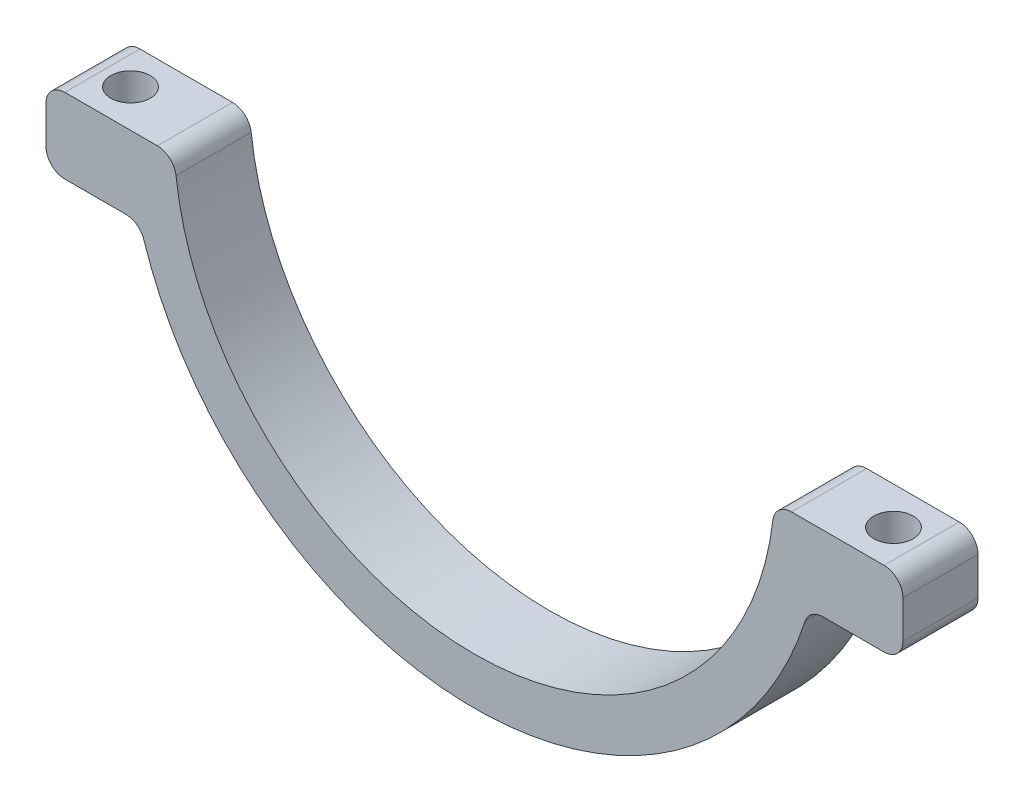
ISO-10303-21;
HEADER;
FILE_DESCRIPTION(('STEP AP214'),'2;1');
FILE_NAME('part.step','',(''),(''),'','','');
FILE_SCHEMA(('AUTOMOTIVE_DESIGN { 1 0 10303 214 1 1 1 1 }'));
ENDSEC;
DATA;
#1=APPLICATION_CONTEXT('core data for automotive mechanical design processes');
#2=APPLICATION_PROTOCOL_DEFINITION('international standard','automotive_design',2000,#1);
#3=PRODUCT_CONTEXT('',#1,'mechanical');
#4=PRODUCT('Part','Part','',(#3));
#5=PRODUCT_RELATED_PRODUCT_CATEGORY('part','',(#4));
#6=PRODUCT_DEFINITION_FORMATION('','',#4);
#7=PRODUCT_DEFINITION_CONTEXT('part definition',#1,'design');
#8=PRODUCT_DEFINITION('design','',#6,#7);
#9=PRODUCT_DEFINITION_SHAPE('','',#8);
#10=(LENGTH_UNIT() NAMED_UNIT(*) SI_UNIT(.MILLI.,.METRE.));
#11=(NAMED_UNIT(*) PLANE_ANGLE_UNIT() SI_UNIT($,.RADIAN.));
#12=(NAMED_UNIT(*) SI_UNIT($,.STERADIAN.) SOLID_ANGLE_UNIT());
#13=UNCERTAINTY_MEASURE_WITH_UNIT(LENGTH_MEASURE(1.E-05),#10,'distance_accuracy_value','');
#14=(GEOMETRIC_REPRESENTATION_CONTEXT(3) GLOBAL_UNCERTAINTY_ASSIGNED_CONTEXT((#13)) GLOBAL_UNIT_ASSIGNED_CONTEXT((#10,
#11,#12)) REPRESENTATION_CONTEXT('',''));
#15=CARTESIAN_POINT('',(0.,0.,0.));
#16=DIRECTION('',(0.,0.,1.));
#17=DIRECTION('',(1.,0.,0.));
#18=AXIS2_PLACEMENT_3D('',#15,#16,#17);
#19=CARTESIAN_POINT('',(-45.6230262611138,-10.,8.));
#20=DIRECTION('',(1.,0.,0.));
#21=DIRECTION('',(0.,0.,-1.));
#22=AXIS2_PLACEMENT_3D('',#19,#20,#21);
#23=PLANE('',#22);
#24=DIRECTION('',(0.,-1.,0.));
#25=VECTOR('',#24,1.);
#26=CARTESIAN_POINT('',(-45.6230262611138,-10.,0.));
#27=LINE('',#26,#25);
#28=CARTESIAN_POINT('',(-45.6230262611138,-4.,0.));
#29=VERTEX_POINT('',#28);
#30=CARTESIAN_POINT('',(-45.6230262611138,-8.,0.));
#31=VERTEX_POINT('',#30);
#32=EDGE_CURVE('E277',#29,#31,#27,.T.);
#33=ORIENTED_EDGE('',*,*,#32,.T.);
#34=DIRECTION('',(0.,0.,-1.));
#35=VECTOR('',#34,1.);
#36=CARTESIAN_POINT('',(-45.6230262611138,-8.,8.));
#37=LINE('',#36,#35);
#38=CARTESIAN_POINT('',(-45.6230262611138,-8.,8.));
#39=VERTEX_POINT('',#38);
#40=EDGE_CURVE('E245',#31,#39,#37,.F.);
#41=ORIENTED_EDGE('',*,*,#40,.T.);
#42=DIRECTION('',(0.,-1.,0.));
#43=VECTOR('',#42,1.);
#44=CARTESIAN_POINT('',(-45.6230262611138,-10.,8.));
#45=LINE('',#44,#43);
#46=CARTESIAN_POINT('',(-45.6230262611138,-4.,8.));
#47=VERTEX_POINT('',#46);
#48=EDGE_CURVE('E198',#47,#39,#45,.T.);
#49=ORIENTED_EDGE('',*,*,#48,.F.);
#50=DIRECTION('',(0.,0.,-1.));
#51=VECTOR('',#50,1.);
#52=CARTESIAN_POINT('',(-45.6230262611138,-4.,8.));
#53=LINE('',#52,#51);
#54=EDGE_CURVE('E242',#47,#29,#53,.T.);
#55=ORIENTED_EDGE('',*,*,#54,.T.);
#56=EDGE_LOOP('',(#33,#41,#49,#55));
#57=FACE_BOUND('',#56,.T.);
#58=ADVANCED_FACE('F44',(#57),#23,.F.);
#59=CARTESIAN_POINT('',(-35.6230262611138,-10.,8.));
#60=DIRECTION('',(0.,1.,0.));
#61=DIRECTION('',(-1.,0.,0.));
#62=AXIS2_PLACEMENT_3D('',#59,#60,#61);
#63=PLANE('',#62);
#64=CARTESIAN_POINT('',(-40.6230262611137,-10.,4.));
#65=DIRECTION('',(0.,1.,0.));
#66=DIRECTION('',(-1.,0.,0.));
#67=AXIS2_PLACEMENT_3D('',#64,#65,#66);
#68=CIRCLE('',#67,1.65);
#69=CARTESIAN_POINT('',(-42.2730262611137,-10.,4.));
#70=VERTEX_POINT('',#69);
#71=EDGE_CURVE('E207',#70,#70,#68,.F.);
#72=ORIENTED_EDGE('',*,*,#71,.F.);
#73=EDGE_LOOP('',(#72));
#74=FACE_BOUND('',#73,.T.);
#75=DIRECTION('',(1.,0.,0.));
#76=VECTOR('',#75,1.);
#77=CARTESIAN_POINT('',(-35.6230262611138,-10.,8.));
#78=LINE('',#77,#76);
#79=CARTESIAN_POINT('',(-43.6230262611138,-10.,8.));
#80=VERTEX_POINT('',#79);
#81=CARTESIAN_POINT('',(-37.1079506305589,-10.,8.));
#82=VERTEX_POINT('',#81);
#83=EDGE_CURVE('E286',#80,#82,#78,.T.);
#84=ORIENTED_EDGE('',*,*,#83,.F.);
#85=DIRECTION('',(0.,0.,-1.));
#86=VECTOR('',#85,1.);
#87=CARTESIAN_POINT('',(-43.6230262611138,-10.,8.));
#88=LINE('',#87,#86);
#89=CARTESIAN_POINT('',(-43.6230262611138,-10.,0.));
#90=VERTEX_POINT('',#89);
#91=EDGE_CURVE('E239',#80,#90,#88,.T.);
#92=ORIENTED_EDGE('',*,*,#91,.T.);
#93=DIRECTION('',(1.,0.,0.));
#94=VECTOR('',#93,1.);
#95=CARTESIAN_POINT('',(-35.6230262611138,-10.,0.));
#96=LINE('',#95,#94);
#97=CARTESIAN_POINT('',(-37.1079506305589,-10.,0.));
#98=VERTEX_POINT('',#97);
#99=EDGE_CURVE('E267',#90,#98,#96,.T.);
#100=ORIENTED_EDGE('',*,*,#99,.T.);
#101=DIRECTION('',(0.,0.,1.));
#102=VECTOR('',#101,1.);
#103=CARTESIAN_POINT('',(-37.1079506305589,-10.,8.));
#104=LINE('',#103,#102);
#105=EDGE_CURVE('E237',#98,#82,#104,.T.);
#106=ORIENTED_EDGE('',*,*,#105,.T.);
#107=EDGE_LOOP('',(#84,#92,#100,#106));
#108=FACE_BOUND('',#107,.T.);
#109=ADVANCED_FACE('F274',(#74,#108),#63,.F.);
#110=CARTESIAN_POINT('',(0.,0.,8.));
#111=DIRECTION('',(0.,0.,-1.));
#112=DIRECTION('',(-1.,0.,0.));
#113=AXIS2_PLACEMENT_3D('',#110,#111,#112);
#114=CYLINDRICAL_SURFACE('',#113,37.);
#115=CARTESIAN_POINT('',(0.,0.,0.));
#116=DIRECTION('',(0.,0.,1.));
#117=DIRECTION('',(1.,0.,0.));
#118=AXIS2_PLACEMENT_3D('',#115,#116,#117);
#119=CIRCLE('',#118,37.);
#120=CARTESIAN_POINT('',(-35.2049788033508,-11.3846153846154,0.));
#121=VERTEX_POINT('',#120);
#122=CARTESIAN_POINT('',(35.2049788033508,-11.3846153846154,0.));
#123=VERTEX_POINT('',#122);
#124=EDGE_CURVE('E190',#121,#123,#119,.T.);
#125=ORIENTED_EDGE('',*,*,#124,.T.);
#126=DIRECTION('',(0.,0.,-1.));
#127=VECTOR('',#126,1.);
#128=CARTESIAN_POINT('',(35.2049788033508,-11.3846153846154,8.));
#129=LINE('',#128,#127);
#130=CARTESIAN_POINT('',(35.2049788033508,-11.3846153846154,8.));
#131=VERTEX_POINT('',#130);
#132=EDGE_CURVE('E259',#123,#131,#129,.F.);
#133=ORIENTED_EDGE('',*,*,#132,.T.);
#134=CARTESIAN_POINT('',(0.,0.,8.));
#135=DIRECTION('',(0.,0.,1.));
#136=DIRECTION('',(1.,0.,0.));
#137=AXIS2_PLACEMENT_3D('',#134,#135,#136);
#138=CIRCLE('',#137,37.);
#139=CARTESIAN_POINT('',(-35.2049788033508,-11.3846153846154,8.));
#140=VERTEX_POINT('',#139);
#141=EDGE_CURVE('E284',#140,#131,#138,.T.);
#142=ORIENTED_EDGE('',*,*,#141,.F.);
#143=DIRECTION('',(0.,0.,-1.));
#144=VECTOR('',#143,1.);
#145=CARTESIAN_POINT('',(-35.2049788033508,-11.3846153846154,8.));
#146=LINE('',#145,#144);
#147=EDGE_CURVE('E256',#140,#121,#146,.T.);
#148=ORIENTED_EDGE('',*,*,#147,.T.);
#149=EDGE_LOOP('',(#125,#133,#142,#148));
#150=FACE_BOUND('',#149,.T.);
#151=ADVANCED_FACE('F288',(#150),#114,.T.);
#152=CARTESIAN_POINT('',(35.6230262611138,-10.,8.));
#153=DIRECTION('',(0.,1.,0.));
#154=DIRECTION('',(-1.,0.,0.));
#155=AXIS2_PLACEMENT_3D('',#152,#153,#154);
#156=PLANE('',#155);
#157=CARTESIAN_POINT('',(40.6230262611137,-10.,4.));
#158=DIRECTION('',(0.,1.,0.));
#159=DIRECTION('',(-1.,0.,0.));
#160=AXIS2_PLACEMENT_3D('',#157,#158,#159);
#161=CIRCLE('',#160,1.65);
#162=CARTESIAN_POINT('',(38.9730262611137,-10.,4.));
#163=VERTEX_POINT('',#162);
#164=EDGE_CURVE('E202',#163,#163,#161,.T.);
#165=ORIENTED_EDGE('',*,*,#164,.T.);
#166=EDGE_LOOP('',(#165));
#167=FACE_BOUND('',#166,.T.);
#168=DIRECTION('',(1.,0.,0.));
#169=VECTOR('',#168,1.);
#170=CARTESIAN_POINT('',(35.6230262611138,-10.,0.));
#171=LINE('',#170,#169);
#172=CARTESIAN_POINT('',(37.1079506305589,-10.,0.));
#173=VERTEX_POINT('',#172);
#174=CARTESIAN_POINT('',(43.6230262611138,-10.,0.));
#175=VERTEX_POINT('',#174);
#176=EDGE_CURVE('E185',#173,#175,#171,.T.);
#177=ORIENTED_EDGE('',*,*,#176,.T.);
#178=DIRECTION('',(0.,0.,-1.));
#179=VECTOR('',#178,1.);
#180=CARTESIAN_POINT('',(43.6230262611138,-10.,8.));
#181=LINE('',#180,#179);
#182=CARTESIAN_POINT('',(43.6230262611138,-10.,8.));
#183=VERTEX_POINT('',#182);
#184=EDGE_CURVE('E163',#175,#183,#181,.F.);
#185=ORIENTED_EDGE('',*,*,#184,.T.);
#186=DIRECTION('',(1.,0.,0.));
#187=VECTOR('',#186,1.);
#188=CARTESIAN_POINT('',(35.6230262611138,-10.,8.));
#189=LINE('',#188,#187);
#190=CARTESIAN_POINT('',(37.1079506305589,-10.,8.));
#191=VERTEX_POINT('',#190);
#192=EDGE_CURVE('E290',#191,#183,#189,.T.);
#193=ORIENTED_EDGE('',*,*,#192,.F.);
#194=DIRECTION('',(0.,0.,1.));
#195=VECTOR('',#194,1.);
#196=CARTESIAN_POINT('',(37.1079506305589,-10.,0.));
#197=LINE('',#196,#195);
#198=EDGE_CURVE('E168',#191,#173,#197,.F.);
#199=ORIENTED_EDGE('',*,*,#198,.T.);
#200=EDGE_LOOP('',(#177,#185,#193,#199));
#201=FACE_BOUND('',#200,.T.);
#202=ADVANCED_FACE('F310',(#167,#201),#156,.F.);
#203=CARTESIAN_POINT('',(45.6230262611138,-10.,8.));
#204=DIRECTION('',(-1.,0.,0.));
#205=DIRECTION('',(0.,0.,1.));
#206=AXIS2_PLACEMENT_3D('',#203,#204,#205);
#207=PLANE('',#206);
#208=DIRECTION('',(0.,1.,0.));
#209=VECTOR('',#208,1.);
#210=CARTESIAN_POINT('',(45.6230262611138,-10.,8.));
#211=LINE('',#210,#209);
#212=CARTESIAN_POINT('',(45.6230262611138,-8.,8.));
#213=VERTEX_POINT('',#212);
#214=CARTESIAN_POINT('',(45.6230262611138,-4.,8.));
#215=VERTEX_POINT('',#214);
#216=EDGE_CURVE('E178',#213,#215,#211,.T.);
#217=ORIENTED_EDGE('',*,*,#216,.F.);
#218=DIRECTION('',(0.,0.,-1.));
#219=VECTOR('',#218,1.);
#220=CARTESIAN_POINT('',(45.6230262611138,-8.,8.));
#221=LINE('',#220,#219);
#222=CARTESIAN_POINT('',(45.6230262611138,-8.,0.));
#223=VERTEX_POINT('',#222);
#224=EDGE_CURVE('E162',#213,#223,#221,.T.);
#225=ORIENTED_EDGE('',*,*,#224,.T.);
#226=DIRECTION('',(0.,1.,0.));
#227=VECTOR('',#226,1.);
#228=CARTESIAN_POINT('',(45.6230262611138,-10.,0.));
#229=LINE('',#228,#227);
#230=CARTESIAN_POINT('',(45.6230262611138,-4.,0.));
#231=VERTEX_POINT('',#230);
#232=EDGE_CURVE('E175',#223,#231,#229,.T.);
#233=ORIENTED_EDGE('',*,*,#232,.T.);
#234=DIRECTION('',(0.,0.,-1.));
#235=VECTOR('',#234,1.);
#236=CARTESIAN_POINT('',(45.6230262611138,-4.,8.));
#237=LINE('',#236,#235);
#238=EDGE_CURVE('E180',#231,#215,#237,.F.);
#239=ORIENTED_EDGE('',*,*,#238,.T.);
#240=EDGE_LOOP('',(#217,#225,#233,#239));
#241=FACE_BOUND('',#240,.T.);
#242=ADVANCED_FACE('F174',(#241),#207,.F.);
#243=CARTESIAN_POINT('',(31.9374388453426,-2.,8.));
#244=DIRECTION('',(0.,-1.,0.));
#245=DIRECTION('',(1.,0.,0.));
#246=AXIS2_PLACEMENT_3D('',#243,#244,#245);
#247=PLANE('',#246);
#248=CARTESIAN_POINT('',(40.6230262611138,-2.,4.));
#249=DIRECTION('',(0.,-1.,0.));
#250=DIRECTION('',(1.,0.,0.));
#251=AXIS2_PLACEMENT_3D('',#248,#249,#250);
#252=CIRCLE('',#251,2.1);
#253=CARTESIAN_POINT('',(42.7230262611137,-2.,4.));
#254=VERTEX_POINT('',#253);
#255=EDGE_CURVE('E588',#254,#254,#252,.T.);
#256=ORIENTED_EDGE('',*,*,#255,.T.);
#257=EDGE_LOOP('',(#256));
#258=FACE_BOUND('',#257,.T.);
#259=DIRECTION('',(-1.,0.,0.));
#260=VECTOR('',#259,1.);
#261=CARTESIAN_POINT('',(31.9374388453426,-2.,8.));
#262=LINE('',#261,#260);
#263=CARTESIAN_POINT('',(43.6230262611138,-2.,8.));
#264=VERTEX_POINT('',#263);
#265=CARTESIAN_POINT('',(33.7638860322683,-2.,8.));
#266=VERTEX_POINT('',#265);
#267=EDGE_CURVE('E297',#264,#266,#262,.T.);
#268=ORIENTED_EDGE('',*,*,#267,.F.);
#269=DIRECTION('',(0.,0.,-1.));
#270=VECTOR('',#269,1.);
#271=CARTESIAN_POINT('',(43.6230262611138,-2.,8.));
#272=LINE('',#271,#270);
#273=CARTESIAN_POINT('',(43.6230262611138,-2.,0.));
#274=VERTEX_POINT('',#273);
#275=EDGE_CURVE('E234',#264,#274,#272,.T.);
#276=ORIENTED_EDGE('',*,*,#275,.T.);
#277=DIRECTION('',(-1.,0.,0.));
#278=VECTOR('',#277,1.);
#279=CARTESIAN_POINT('',(31.9374388453426,-2.,0.));
#280=LINE('',#279,#278);
#281=CARTESIAN_POINT('',(33.7638860322683,-2.,0.));
#282=VERTEX_POINT('',#281);
#283=EDGE_CURVE('E184',#274,#282,#280,.T.);
#284=ORIENTED_EDGE('',*,*,#283,.T.);
#285=DIRECTION('',(0.,0.,-1.));
#286=VECTOR('',#285,1.);
#287=CARTESIAN_POINT('',(33.7638860322683,-2.,8.));
#288=LINE('',#287,#286);
#289=EDGE_CURVE('E232',#282,#266,#288,.F.);
#290=ORIENTED_EDGE('',*,*,#289,.T.);
#291=EDGE_LOOP('',(#268,#276,#284,#290));
#292=FACE_BOUND('',#291,.T.);
#293=ADVANCED_FACE('F318',(#258,#292),#247,.F.);
#294=CARTESIAN_POINT('',(0.,0.,8.));
#295=DIRECTION('',(0.,0.,-1.));
#296=DIRECTION('',(-1.,0.,0.));
#297=AXIS2_PLACEMENT_3D('',#294,#295,#296);
#298=CYLINDRICAL_SURFACE('',#297,32.);
#299=CARTESIAN_POINT('',(0.,0.,0.));
#300=DIRECTION('',(0.,0.,-1.));
#301=DIRECTION('',(-1.,0.,0.));
#302=AXIS2_PLACEMENT_3D('',#299,#300,#301);
#303=CIRCLE('',#302,32.);
#304=CARTESIAN_POINT('',(31.7777750891937,-3.76470588235294,0.));
#305=VERTEX_POINT('',#304);
#306=CARTESIAN_POINT('',(-31.7777750891937,-3.76470588235294,0.));
#307=VERTEX_POINT('',#306);
#308=EDGE_CURVE('E188',#305,#307,#303,.T.);
#309=ORIENTED_EDGE('',*,*,#308,.T.);
#310=DIRECTION('',(0.,0.,-1.));
#311=VECTOR('',#310,1.);
#312=CARTESIAN_POINT('',(-31.7777750891937,-3.76470588235294,8.));
#313=LINE('',#312,#311);
#314=CARTESIAN_POINT('',(-31.7777750891937,-3.76470588235294,8.));
#315=VERTEX_POINT('',#314);
#316=EDGE_CURVE('E254',#307,#315,#313,.F.);
#317=ORIENTED_EDGE('',*,*,#316,.T.);
#318=CARTESIAN_POINT('',(0.,0.,8.));
#319=DIRECTION('',(0.,0.,-1.));
#320=DIRECTION('',(-1.,0.,0.));
#321=AXIS2_PLACEMENT_3D('',#318,#319,#320);
#322=CIRCLE('',#321,32.);
#323=CARTESIAN_POINT('',(31.7777750891937,-3.76470588235294,8.));
#324=VERTEX_POINT('',#323);
#325=EDGE_CURVE('E300',#324,#315,#322,.T.);
#326=ORIENTED_EDGE('',*,*,#325,.F.);
#327=DIRECTION('',(0.,0.,-1.));
#328=VECTOR('',#327,1.);
#329=CARTESIAN_POINT('',(31.7777750891937,-3.76470588235294,8.));
#330=LINE('',#329,#328);
#331=EDGE_CURVE('E251',#324,#305,#330,.T.);
#332=ORIENTED_EDGE('',*,*,#331,.T.);
#333=EDGE_LOOP('',(#309,#317,#326,#332));
#334=FACE_BOUND('',#333,.T.);
#335=ADVANCED_FACE('F440',(#334),#298,.F.);
#336=CARTESIAN_POINT('',(-31.9374388453426,-2.,8.));
#337=DIRECTION('',(0.,-1.,0.));
#338=DIRECTION('',(1.,0.,0.));
#339=AXIS2_PLACEMENT_3D('',#336,#337,#338);
#340=PLANE('',#339);
#341=CARTESIAN_POINT('',(-40.6230262611138,-2.,4.));
#342=DIRECTION('',(0.,1.,0.));
#343=DIRECTION('',(-1.,0.,0.));
#344=AXIS2_PLACEMENT_3D('',#341,#342,#343);
#345=CIRCLE('',#344,2.1);
#346=CARTESIAN_POINT('',(-42.7230262611137,-2.,4.));
#347=VERTEX_POINT('',#346);
#348=EDGE_CURVE('E612',#347,#347,#345,.T.);
#349=ORIENTED_EDGE('',*,*,#348,.F.);
#350=EDGE_LOOP('',(#349));
#351=FACE_BOUND('',#350,.T.);
#352=DIRECTION('',(-1.,0.,0.));
#353=VECTOR('',#352,1.);
#354=CARTESIAN_POINT('',(-31.9374388453426,-2.,0.));
#355=LINE('',#354,#353);
#356=CARTESIAN_POINT('',(-33.7638860322683,-2.,0.));
#357=VERTEX_POINT('',#356);
#358=CARTESIAN_POINT('',(-43.6230262611138,-2.,0.));
#359=VERTEX_POINT('',#358);
#360=EDGE_CURVE('E196',#357,#359,#355,.T.);
#361=ORIENTED_EDGE('',*,*,#360,.T.);
#362=DIRECTION('',(0.,0.,-1.));
#363=VECTOR('',#362,1.);
#364=CARTESIAN_POINT('',(-43.6230262611138,-2.,8.));
#365=LINE('',#364,#363);
#366=CARTESIAN_POINT('',(-43.6230262611138,-2.,8.));
#367=VERTEX_POINT('',#366);
#368=EDGE_CURVE('E59',#359,#367,#365,.F.);
#369=ORIENTED_EDGE('',*,*,#368,.T.);
#370=DIRECTION('',(-1.,0.,0.));
#371=VECTOR('',#370,1.);
#372=CARTESIAN_POINT('',(-31.9374388453426,-2.,8.));
#373=LINE('',#372,#371);
#374=CARTESIAN_POINT('',(-33.7638860322683,-2.,8.));
#375=VERTEX_POINT('',#374);
#376=EDGE_CURVE('E208',#375,#367,#373,.T.);
#377=ORIENTED_EDGE('',*,*,#376,.F.);
#378=DIRECTION('',(0.,0.,-1.));
#379=VECTOR('',#378,1.);
#380=CARTESIAN_POINT('',(-33.7638860322683,-2.,8.));
#381=LINE('',#380,#379);
#382=EDGE_CURVE('E247',#375,#357,#381,.T.);
#383=ORIENTED_EDGE('',*,*,#382,.T.);
#384=EDGE_LOOP('',(#361,#369,#377,#383));
#385=FACE_BOUND('',#384,.T.);
#386=ADVANCED_FACE('F430',(#351,#385),#340,.F.);
#387=CARTESIAN_POINT('',(0.,0.,8.));
#388=DIRECTION('',(0.,0.,-1.));
#389=DIRECTION('',(-1.,0.,0.));
#390=AXIS2_PLACEMENT_3D('',#387,#388,#389);
#391=PLANE('',#390);
#392=ORIENTED_EDGE('',*,*,#192,.T.);
#393=CARTESIAN_POINT('',(43.6230262611138,-8.,8.));
#394=DIRECTION('',(0.,0.,-1.));
#395=DIRECTION('',(-1.,0.,0.));
#396=AXIS2_PLACEMENT_3D('',#393,#394,#395);
#397=CIRCLE('',#396,2.);
#398=EDGE_CURVE('E230',#183,#213,#397,.F.);
#399=ORIENTED_EDGE('',*,*,#398,.T.);
#400=ORIENTED_EDGE('',*,*,#216,.T.);
#401=CARTESIAN_POINT('',(43.6230262611138,-4.,8.));
#402=DIRECTION('',(0.,0.,-1.));
#403=DIRECTION('',(-1.,0.,0.));
#404=AXIS2_PLACEMENT_3D('',#401,#402,#403);
#405=CIRCLE('',#404,2.);
#406=EDGE_CURVE('E228',#215,#264,#405,.F.);
#407=ORIENTED_EDGE('',*,*,#406,.T.);
#408=ORIENTED_EDGE('',*,*,#267,.T.);
#409=CARTESIAN_POINT('',(33.7638860322683,-4.,8.));
#410=DIRECTION('',(0.,0.,-1.));
#411=DIRECTION('',(-1.,0.,0.));
#412=AXIS2_PLACEMENT_3D('',#409,#410,#411);
#413=CIRCLE('',#412,2.);
#414=EDGE_CURVE('E221',#266,#324,#413,.F.);
#415=ORIENTED_EDGE('',*,*,#414,.T.);
#416=ORIENTED_EDGE('',*,*,#325,.T.);
#417=CARTESIAN_POINT('',(-33.7638860322683,-4.,8.));
#418=DIRECTION('',(0.,0.,-1.));
#419=DIRECTION('',(-1.,0.,0.));
#420=AXIS2_PLACEMENT_3D('',#417,#418,#419);
#421=CIRCLE('',#420,2.);
#422=EDGE_CURVE('E66',#315,#375,#421,.F.);
#423=ORIENTED_EDGE('',*,*,#422,.T.);
#424=ORIENTED_EDGE('',*,*,#376,.T.);
#425=CARTESIAN_POINT('',(-43.6230262611138,-4.,8.));
#426=DIRECTION('',(0.,0.,-1.));
#427=DIRECTION('',(-1.,0.,0.));
#428=AXIS2_PLACEMENT_3D('',#425,#426,#427);
#429=CIRCLE('',#428,2.);
#430=EDGE_CURVE('E224',#367,#47,#429,.F.);
#431=ORIENTED_EDGE('',*,*,#430,.T.);
#432=ORIENTED_EDGE('',*,*,#48,.T.);
#433=CARTESIAN_POINT('',(-43.6230262611138,-8.,8.));
#434=DIRECTION('',(0.,0.,-1.));
#435=DIRECTION('',(-1.,0.,0.));
#436=AXIS2_PLACEMENT_3D('',#433,#434,#435);
#437=CIRCLE('',#436,2.);
#438=EDGE_CURVE('E226',#39,#80,#437,.F.);
#439=ORIENTED_EDGE('',*,*,#438,.T.);
#440=ORIENTED_EDGE('',*,*,#83,.T.);
#441=CARTESIAN_POINT('',(-37.1079506305589,-12.,8.));
#442=DIRECTION('',(0.,0.,-1.));
#443=DIRECTION('',(-1.,0.,0.));
#444=AXIS2_PLACEMENT_3D('',#441,#442,#443);
#445=CIRCLE('',#444,2.);
#446=EDGE_CURVE('E11',#82,#140,#445,.T.);
#447=ORIENTED_EDGE('',*,*,#446,.T.);
#448=ORIENTED_EDGE('',*,*,#141,.T.);
#449=CARTESIAN_POINT('',(37.1079506305589,-12.,8.));
#450=DIRECTION('',(0.,0.,-1.));
#451=DIRECTION('',(-1.,0.,0.));
#452=AXIS2_PLACEMENT_3D('',#449,#450,#451);
#453=CIRCLE('',#452,2.);
#454=EDGE_CURVE('E263',#131,#191,#453,.T.);
#455=ORIENTED_EDGE('',*,*,#454,.T.);
#456=EDGE_LOOP('',(#392,#399,#400,#407,#408,#415,#416,#423,#424,#431,#432,#439,#440,#447,#448,#455));
#457=FACE_BOUND('',#456,.T.);
#458=ADVANCED_FACE('F283',(#457),#391,.F.);
#459=CARTESIAN_POINT('',(0.,0.,0.));
#460=DIRECTION('',(0.,0.,-1.));
#461=DIRECTION('',(-1.,0.,0.));
#462=AXIS2_PLACEMENT_3D('',#459,#460,#461);
#463=PLANE('',#462);
#464=ORIENTED_EDGE('',*,*,#232,.F.);
#465=CARTESIAN_POINT('',(43.6230262611138,-8.,0.));
#466=DIRECTION('',(0.,0.,-1.));
#467=DIRECTION('',(-1.,0.,0.));
#468=AXIS2_PLACEMENT_3D('',#465,#466,#467);
#469=CIRCLE('',#468,2.);
#470=EDGE_CURVE('E158',#223,#175,#469,.T.);
#471=ORIENTED_EDGE('',*,*,#470,.T.);
#472=ORIENTED_EDGE('',*,*,#176,.F.);
#473=CARTESIAN_POINT('',(37.1079506305589,-12.,0.));
#474=DIRECTION('',(0.,0.,-1.));
#475=DIRECTION('',(-1.,0.,0.));
#476=AXIS2_PLACEMENT_3D('',#473,#474,#475);
#477=CIRCLE('',#476,2.);
#478=EDGE_CURVE('E261',#173,#123,#477,.F.);
#479=ORIENTED_EDGE('',*,*,#478,.T.);
#480=ORIENTED_EDGE('',*,*,#124,.F.);
#481=CARTESIAN_POINT('',(-37.1079506305589,-12.,0.));
#482=DIRECTION('',(0.,0.,-1.));
#483=DIRECTION('',(-1.,0.,0.));
#484=AXIS2_PLACEMENT_3D('',#481,#482,#483);
#485=CIRCLE('',#484,2.);
#486=EDGE_CURVE('E52',#121,#98,#485,.F.);
#487=ORIENTED_EDGE('',*,*,#486,.T.);
#488=ORIENTED_EDGE('',*,*,#99,.F.);
#489=CARTESIAN_POINT('',(-43.6230262611138,-8.,0.));
#490=DIRECTION('',(0.,0.,-1.));
#491=DIRECTION('',(-1.,0.,0.));
#492=AXIS2_PLACEMENT_3D('',#489,#490,#491);
#493=CIRCLE('',#492,2.);
#494=EDGE_CURVE('E215',#90,#31,#493,.T.);
#495=ORIENTED_EDGE('',*,*,#494,.T.);
#496=ORIENTED_EDGE('',*,*,#32,.F.);
#497=CARTESIAN_POINT('',(-43.6230262611138,-4.,0.));
#498=DIRECTION('',(0.,0.,-1.));
#499=DIRECTION('',(-1.,0.,0.));
#500=AXIS2_PLACEMENT_3D('',#497,#498,#499);
#501=CIRCLE('',#500,2.);
#502=EDGE_CURVE('E213',#29,#359,#501,.T.);
#503=ORIENTED_EDGE('',*,*,#502,.T.);
#504=ORIENTED_EDGE('',*,*,#360,.F.);
#505=CARTESIAN_POINT('',(-33.7638860322683,-4.,0.));
#506=DIRECTION('',(0.,0.,-1.));
#507=DIRECTION('',(-1.,0.,0.));
#508=AXIS2_PLACEMENT_3D('',#505,#506,#507);
#509=CIRCLE('',#508,2.);
#510=EDGE_CURVE('E211',#357,#307,#509,.T.);
#511=ORIENTED_EDGE('',*,*,#510,.T.);
#512=ORIENTED_EDGE('',*,*,#308,.F.);
#513=CARTESIAN_POINT('',(33.7638860322683,-4.,0.));
#514=DIRECTION('',(0.,0.,-1.));
#515=DIRECTION('',(-1.,0.,0.));
#516=AXIS2_PLACEMENT_3D('',#513,#514,#515);
#517=CIRCLE('',#516,2.);
#518=EDGE_CURVE('E179',#305,#282,#517,.T.);
#519=ORIENTED_EDGE('',*,*,#518,.T.);
#520=ORIENTED_EDGE('',*,*,#283,.F.);
#521=CARTESIAN_POINT('',(43.6230262611138,-4.,0.));
#522=DIRECTION('',(0.,0.,-1.));
#523=DIRECTION('',(-1.,0.,0.));
#524=AXIS2_PLACEMENT_3D('',#521,#522,#523);
#525=CIRCLE('',#524,2.);
#526=EDGE_CURVE('E169',#274,#231,#525,.T.);
#527=ORIENTED_EDGE('',*,*,#526,.T.);
#528=EDGE_LOOP('',(#464,#471,#472,#479,#480,#487,#488,#495,#496,#503,#504,#511,#512,#519,#520,#527));
#529=FACE_BOUND('',#528,.T.);
#530=ADVANCED_FACE('F182',(#529),#463,.T.);
#531=CARTESIAN_POINT('',(40.6230262611138,-7.,4.));
#532=DIRECTION('',(0.,1.,0.));
#533=DIRECTION('',(-1.,0.,0.));
#534=AXIS2_PLACEMENT_3D('',#531,#532,#533);
#535=CYLINDRICAL_SURFACE('',#534,2.1);
#536=CARTESIAN_POINT('',(40.6230262611138,-7.,4.));
#537=DIRECTION('',(0.,-1.,0.));
#538=DIRECTION('',(1.,0.,0.));
#539=AXIS2_PLACEMENT_3D('',#536,#537,#538);
#540=CIRCLE('',#539,2.1);
#541=CARTESIAN_POINT('',(42.7230262611137,-7.,4.));
#542=VERTEX_POINT('',#541);
#543=EDGE_CURVE('E304',#542,#542,#540,.T.);
#544=ORIENTED_EDGE('',*,*,#543,.T.);
#545=EDGE_LOOP('',(#544));
#546=FACE_BOUND('',#545,.T.);
#547=ORIENTED_EDGE('',*,*,#255,.F.);
#548=EDGE_LOOP('',(#547));
#549=FACE_BOUND('',#548,.T.);
#550=ADVANCED_FACE('F418',(#546,#549),#535,.F.);
#551=CARTESIAN_POINT('',(40.6230262611138,-7.,4.));
#552=DIRECTION('',(0.,-1.,0.));
#553=DIRECTION('',(1.,0.,0.));
#554=AXIS2_PLACEMENT_3D('',#551,#552,#553);
#555=PLANE('',#554);
#556=CARTESIAN_POINT('',(40.6230262611138,-7.,4.));
#557=DIRECTION('',(0.,-1.,0.));
#558=DIRECTION('',(1.,0.,0.));
#559=AXIS2_PLACEMENT_3D('',#556,#557,#558);
#560=CIRCLE('',#559,1.65);
#561=CARTESIAN_POINT('',(42.2730262611137,-7.,4.));
#562=VERTEX_POINT('',#561);
#563=EDGE_CURVE('E199',#562,#562,#560,.T.);
#564=ORIENTED_EDGE('',*,*,#563,.T.);
#565=EDGE_LOOP('',(#564));
#566=FACE_BOUND('',#565,.T.);
#567=ORIENTED_EDGE('',*,*,#543,.F.);
#568=EDGE_LOOP('',(#567));
#569=FACE_BOUND('',#568,.T.);
#570=ADVANCED_FACE('F535',(#566,#569),#555,.F.);
#571=CARTESIAN_POINT('',(40.6230262611137,-37.,4.));
#572=DIRECTION('',(0.,1.,0.));
#573=DIRECTION('',(-1.,0.,0.));
#574=AXIS2_PLACEMENT_3D('',#571,#572,#573);
#575=CYLINDRICAL_SURFACE('',#574,1.65);
#576=ORIENTED_EDGE('',*,*,#563,.F.);
#577=EDGE_LOOP('',(#576));
#578=FACE_BOUND('',#577,.T.);
#579=ORIENTED_EDGE('',*,*,#164,.F.);
#580=EDGE_LOOP('',(#579));
#581=FACE_BOUND('',#580,.T.);
#582=ADVANCED_FACE('F524',(#578,#581),#575,.F.);
#583=CARTESIAN_POINT('',(-40.6230262611138,-7.,4.));
#584=DIRECTION('',(0.,1.,0.));
#585=DIRECTION('',(-1.,0.,0.));
#586=AXIS2_PLACEMENT_3D('',#583,#584,#585);
#587=CYLINDRICAL_SURFACE('',#586,2.1);
#588=CARTESIAN_POINT('',(-40.6230262611138,-7.,4.));
#589=DIRECTION('',(0.,1.,0.));
#590=DIRECTION('',(-1.,0.,0.));
#591=AXIS2_PLACEMENT_3D('',#588,#589,#590);
#592=CIRCLE('',#591,2.1);
#593=CARTESIAN_POINT('',(-42.7230262611137,-7.,4.));
#594=VERTEX_POINT('',#593);
#595=EDGE_CURVE('E203',#594,#594,#592,.T.);
#596=ORIENTED_EDGE('',*,*,#595,.F.);
#597=EDGE_LOOP('',(#596));
#598=FACE_BOUND('',#597,.T.);
#599=ORIENTED_EDGE('',*,*,#348,.T.);
#600=EDGE_LOOP('',(#599));
#601=FACE_BOUND('',#600,.T.);
#602=ADVANCED_FACE('F513',(#598,#601),#587,.F.);
#603=CARTESIAN_POINT('',(-40.6230262611138,-7.,4.));
#604=DIRECTION('',(0.,-1.,0.));
#605=DIRECTION('',(-1.,0.,0.));
#606=AXIS2_PLACEMENT_3D('',#603,#604,#605);
#607=PLANE('',#606);
#608=CARTESIAN_POINT('',(-40.6230262611138,-7.,4.));
#609=DIRECTION('',(0.,-1.,0.));
#610=DIRECTION('',(1.,0.,0.));
#611=AXIS2_PLACEMENT_3D('',#608,#609,#610);
#612=CIRCLE('',#611,1.65);
#613=CARTESIAN_POINT('',(-38.9730262611138,-7.,4.));
#614=VERTEX_POINT('',#613);
#615=EDGE_CURVE('E204',#614,#614,#612,.F.);
#616=ORIENTED_EDGE('',*,*,#615,.F.);
#617=EDGE_LOOP('',(#616));
#618=FACE_BOUND('',#617,.T.);
#619=ORIENTED_EDGE('',*,*,#595,.T.);
#620=EDGE_LOOP('',(#619));
#621=FACE_BOUND('',#620,.T.);
#622=ADVANCED_FACE('F502',(#618,#621),#607,.F.);
#623=CARTESIAN_POINT('',(-40.6230262611137,-37.,4.));
#624=DIRECTION('',(0.,1.,0.));
#625=DIRECTION('',(-1.,0.,0.));
#626=AXIS2_PLACEMENT_3D('',#623,#624,#625);
#627=CYLINDRICAL_SURFACE('',#626,1.65);
#628=ORIENTED_EDGE('',*,*,#615,.T.);
#629=EDGE_LOOP('',(#628));
#630=FACE_BOUND('',#629,.T.);
#631=ORIENTED_EDGE('',*,*,#71,.T.);
#632=EDGE_LOOP('',(#631));
#633=FACE_BOUND('',#632,.T.);
#634=ADVANCED_FACE('F334',(#630,#633),#627,.F.);
#635=CARTESIAN_POINT('',(43.6230262611138,-8.,8.));
#636=DIRECTION('',(0.,0.,-1.));
#637=DIRECTION('',(-1.,0.,0.));
#638=AXIS2_PLACEMENT_3D('',#635,#636,#637);
#639=CYLINDRICAL_SURFACE('',#638,2.);
#640=ORIENTED_EDGE('',*,*,#398,.F.);
#641=ORIENTED_EDGE('',*,*,#184,.F.);
#642=ORIENTED_EDGE('',*,*,#470,.F.);
#643=ORIENTED_EDGE('',*,*,#224,.F.);
#644=EDGE_LOOP('',(#640,#641,#642,#643));
#645=FACE_BOUND('',#644,.T.);
#646=ADVANCED_FACE('F161',(#645),#639,.T.);
#647=CARTESIAN_POINT('',(43.6230262611138,-4.,8.));
#648=DIRECTION('',(0.,0.,-1.));
#649=DIRECTION('',(-1.,0.,0.));
#650=AXIS2_PLACEMENT_3D('',#647,#648,#649);
#651=CYLINDRICAL_SURFACE('',#650,2.);
#652=ORIENTED_EDGE('',*,*,#406,.F.);
#653=ORIENTED_EDGE('',*,*,#238,.F.);
#654=ORIENTED_EDGE('',*,*,#526,.F.);
#655=ORIENTED_EDGE('',*,*,#275,.F.);
#656=EDGE_LOOP('',(#652,#653,#654,#655));
#657=FACE_BOUND('',#656,.T.);
#658=ADVANCED_FACE('F333',(#657),#651,.T.);
#659=CARTESIAN_POINT('',(-43.6230262611138,-8.,8.));
#660=DIRECTION('',(0.,0.,-1.));
#661=DIRECTION('',(-1.,0.,0.));
#662=AXIS2_PLACEMENT_3D('',#659,#660,#661);
#663=CYLINDRICAL_SURFACE('',#662,2.);
#664=ORIENTED_EDGE('',*,*,#438,.F.);
#665=ORIENTED_EDGE('',*,*,#40,.F.);
#666=ORIENTED_EDGE('',*,*,#494,.F.);
#667=ORIENTED_EDGE('',*,*,#91,.F.);
#668=EDGE_LOOP('',(#664,#665,#666,#667));
#669=FACE_BOUND('',#668,.T.);
#670=ADVANCED_FACE('F337',(#669),#663,.T.);
#671=CARTESIAN_POINT('',(-43.6230262611138,-4.,8.));
#672=DIRECTION('',(0.,0.,-1.));
#673=DIRECTION('',(-1.,0.,0.));
#674=AXIS2_PLACEMENT_3D('',#671,#672,#673);
#675=CYLINDRICAL_SURFACE('',#674,2.);
#676=ORIENTED_EDGE('',*,*,#430,.F.);
#677=ORIENTED_EDGE('',*,*,#368,.F.);
#678=ORIENTED_EDGE('',*,*,#502,.F.);
#679=ORIENTED_EDGE('',*,*,#54,.F.);
#680=EDGE_LOOP('',(#676,#677,#678,#679));
#681=FACE_BOUND('',#680,.T.);
#682=ADVANCED_FACE('F341',(#681),#675,.T.);
#683=CARTESIAN_POINT('',(-33.7638860322683,-4.,8.));
#684=DIRECTION('',(0.,0.,-1.));
#685=DIRECTION('',(-1.,0.,0.));
#686=AXIS2_PLACEMENT_3D('',#683,#684,#685);
#687=CYLINDRICAL_SURFACE('',#686,2.);
#688=ORIENTED_EDGE('',*,*,#422,.F.);
#689=ORIENTED_EDGE('',*,*,#316,.F.);
#690=ORIENTED_EDGE('',*,*,#510,.F.);
#691=ORIENTED_EDGE('',*,*,#382,.F.);
#692=EDGE_LOOP('',(#688,#689,#690,#691));
#693=FACE_BOUND('',#692,.T.);
#694=ADVANCED_FACE('F345',(#693),#687,.T.);
#695=CARTESIAN_POINT('',(33.7638860322683,-4.,8.));
#696=DIRECTION('',(0.,0.,-1.));
#697=DIRECTION('',(-1.,0.,0.));
#698=AXIS2_PLACEMENT_3D('',#695,#696,#697);
#699=CYLINDRICAL_SURFACE('',#698,2.);
#700=ORIENTED_EDGE('',*,*,#414,.F.);
#701=ORIENTED_EDGE('',*,*,#289,.F.);
#702=ORIENTED_EDGE('',*,*,#518,.F.);
#703=ORIENTED_EDGE('',*,*,#331,.F.);
#704=EDGE_LOOP('',(#700,#701,#702,#703));
#705=FACE_BOUND('',#704,.T.);
#706=ADVANCED_FACE('F349',(#705),#699,.T.);
#707=CARTESIAN_POINT('',(37.1079506305589,-12.,8.));
#708=DIRECTION('',(0.,0.,-1.));
#709=DIRECTION('',(-1.,0.,0.));
#710=AXIS2_PLACEMENT_3D('',#707,#708,#709);
#711=CYLINDRICAL_SURFACE('',#710,2.);
#712=ORIENTED_EDGE('',*,*,#454,.F.);
#713=ORIENTED_EDGE('',*,*,#132,.F.);
#714=ORIENTED_EDGE('',*,*,#478,.F.);
#715=ORIENTED_EDGE('',*,*,#198,.F.);
#716=EDGE_LOOP('',(#712,#713,#714,#715));
#717=FACE_BOUND('',#716,.T.);
#718=ADVANCED_FACE('F306',(#717),#711,.F.);
#719=CARTESIAN_POINT('',(-37.1079506305589,-12.,8.));
#720=DIRECTION('',(0.,0.,-1.));
#721=DIRECTION('',(-1.,0.,0.));
#722=AXIS2_PLACEMENT_3D('',#719,#720,#721);
#723=CYLINDRICAL_SURFACE('',#722,2.);
#724=ORIENTED_EDGE('',*,*,#446,.F.);
#725=ORIENTED_EDGE('',*,*,#105,.F.);
#726=ORIENTED_EDGE('',*,*,#486,.F.);
#727=ORIENTED_EDGE('',*,*,#147,.F.);
#728=EDGE_LOOP('',(#724,#725,#726,#727));
#729=FACE_BOUND('',#728,.T.);
#730=ADVANCED_FACE('F46',(#729),#723,.F.);
#731=CLOSED_SHELL('',(#58,#109,#151,#202,#242,#293,#335,#386,#458,#530,#550,#570,#582,#602,#622,
#634,#646,#658,#670,#682,#694,#706,#718,#730));
#732=MANIFOLD_SOLID_BREP('B2',#731);
#733=ADVANCED_BREP_SHAPE_REPRESENTATION('',(#18,#732),#14);
#734=SHAPE_DEFINITION_REPRESENTATION(#9,#733);
ENDSEC;
END-ISO-10303-21;
